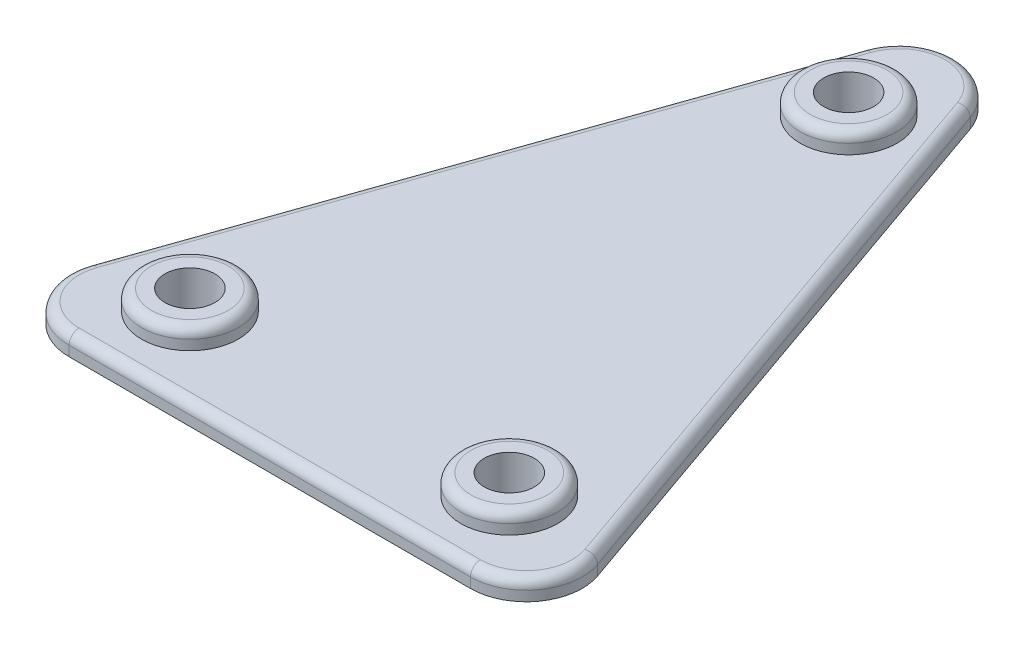
ISO-10303-21;
HEADER;
FILE_DESCRIPTION(('STEP AP214'),'2;1');
FILE_NAME('part.step','',(''),(''),'','','');
FILE_SCHEMA(('AUTOMOTIVE_DESIGN { 1 0 10303 214 1 1 1 1 }'));
ENDSEC;
DATA;
#1=APPLICATION_CONTEXT('core data for automotive mechanical design processes');
#2=APPLICATION_PROTOCOL_DEFINITION('international standard','automotive_design',2000,#1);
#3=PRODUCT_CONTEXT('',#1,'mechanical');
#4=PRODUCT('Part','Part','',(#3));
#5=PRODUCT_RELATED_PRODUCT_CATEGORY('part','',(#4));
#6=PRODUCT_DEFINITION_FORMATION('','',#4);
#7=PRODUCT_DEFINITION_CONTEXT('part definition',#1,'design');
#8=PRODUCT_DEFINITION('design','',#6,#7);
#9=PRODUCT_DEFINITION_SHAPE('','',#8);
#10=(LENGTH_UNIT() NAMED_UNIT(*) SI_UNIT(.MILLI.,.METRE.));
#11=(NAMED_UNIT(*) PLANE_ANGLE_UNIT() SI_UNIT($,.RADIAN.));
#12=(NAMED_UNIT(*) SI_UNIT($,.STERADIAN.) SOLID_ANGLE_UNIT());
#13=UNCERTAINTY_MEASURE_WITH_UNIT(LENGTH_MEASURE(1.E-05),#10,'distance_accuracy_value','');
#14=(GEOMETRIC_REPRESENTATION_CONTEXT(3) GLOBAL_UNCERTAINTY_ASSIGNED_CONTEXT((#13)) GLOBAL_UNIT_ASSIGNED_CONTEXT((#10,
#11,#12)) REPRESENTATION_CONTEXT('',''));
#15=CARTESIAN_POINT('',(0.,0.,0.));
#16=DIRECTION('',(0.,0.,1.));
#17=DIRECTION('',(1.,0.,0.));
#18=AXIS2_PLACEMENT_3D('',#15,#16,#17);
#19=CARTESIAN_POINT('',(-14.,1.,0.));
#20=DIRECTION('',(0.943858356366017,0.,0.330350424728106));
#21=DIRECTION('',(0.330350424728106,0.,-0.943858356366017));
#22=AXIS2_PLACEMENT_3D('',#19,#20,#21);
#23=PLANE('',#22);
#24=DIRECTION('',(0.,-1.,0.));
#25=VECTOR('',#24,1.);
#26=CARTESIAN_POINT('',(-12.6962565837665,1.,-3.72498118923869));
#27=LINE('',#26,#25);
#28=CARTESIAN_POINT('',(-12.6962565837665,0.,-3.72498118923869));
#29=VERTEX_POINT('',#28);
#30=CARTESIAN_POINT('',(-12.6962565837665,0.5,-3.72498118923869));
#31=VERTEX_POINT('',#30);
#32=EDGE_CURVE('E116',#29,#31,#27,.F.);
#33=ORIENTED_EDGE('',*,*,#32,.T.);
#34=DIRECTION('',(-0.330350424728106,0.,0.943858356366017));
#35=VECTOR('',#34,1.);
#36=CARTESIAN_POINT('',(-2.64280339782484,0.5,-32.4491331490719));
#37=LINE('',#36,#35);
#38=CARTESIAN_POINT('',(-2.64280339782485,0.5,-32.4491331490719));
#39=VERTEX_POINT('',#38);
#40=EDGE_CURVE('E11',#31,#39,#37,.F.);
#41=ORIENTED_EDGE('',*,*,#40,.T.);
#42=DIRECTION('',(0.,-1.,0.));
#43=VECTOR('',#42,1.);
#44=CARTESIAN_POINT('',(-2.64280339782485,1.,-32.4491331490719));
#45=LINE('',#44,#43);
#46=CARTESIAN_POINT('',(-2.64280339782485,0.,-32.4491331490719));
#47=VERTEX_POINT('',#46);
#48=EDGE_CURVE('E107',#39,#47,#45,.T.);
#49=ORIENTED_EDGE('',*,*,#48,.T.);
#50=DIRECTION('',(-0.330350424728106,0.,0.943858356366017));
#51=VECTOR('',#50,1.);
#52=CARTESIAN_POINT('',(-14.,0.,0.));
#53=LINE('',#52,#51);
#54=EDGE_CURVE('E110',#47,#29,#53,.T.);
#55=ORIENTED_EDGE('',*,*,#54,.T.);
#56=EDGE_LOOP('',(#33,#41,#49,#55));
#57=FACE_BOUND('',#56,.T.);
#58=ADVANCED_FACE('F33',(#57),#23,.F.);
#59=CARTESIAN_POINT('',(14.,1.,0.));
#60=DIRECTION('',(0.,0.,-1.));
#61=DIRECTION('',(-1.,0.,0.));
#62=AXIS2_PLACEMENT_3D('',#59,#60,#61);
#63=PLANE('',#62);
#64=DIRECTION('',(0.,-1.,0.));
#65=VECTOR('',#64,1.);
#66=CARTESIAN_POINT('',(10.0534531859416,1.,0.));
#67=LINE('',#66,#65);
#68=CARTESIAN_POINT('',(10.0534531859416,0.,0.));
#69=VERTEX_POINT('',#68);
#70=CARTESIAN_POINT('',(10.0534531859416,0.5,0.));
#71=VERTEX_POINT('',#70);
#72=EDGE_CURVE('E151',#69,#71,#67,.F.);
#73=ORIENTED_EDGE('',*,*,#72,.T.);
#74=DIRECTION('',(1.,0.,0.));
#75=VECTOR('',#74,1.);
#76=CARTESIAN_POINT('',(-10.0534531859416,0.5,0.));
#77=LINE('',#76,#75);
#78=CARTESIAN_POINT('',(-10.0534531859416,0.5,0.));
#79=VERTEX_POINT('',#78);
#80=EDGE_CURVE('E58',#71,#79,#77,.F.);
#81=ORIENTED_EDGE('',*,*,#80,.T.);
#82=DIRECTION('',(0.,-1.,0.));
#83=VECTOR('',#82,1.);
#84=CARTESIAN_POINT('',(-10.0534531859416,1.,0.));
#85=LINE('',#84,#83);
#86=CARTESIAN_POINT('',(-10.0534531859416,0.,0.));
#87=VERTEX_POINT('',#86);
#88=EDGE_CURVE('E149',#79,#87,#85,.T.);
#89=ORIENTED_EDGE('',*,*,#88,.T.);
#90=DIRECTION('',(1.,0.,0.));
#91=VECTOR('',#90,1.);
#92=CARTESIAN_POINT('',(14.,0.,0.));
#93=LINE('',#92,#91);
#94=EDGE_CURVE('E132',#87,#69,#93,.T.);
#95=ORIENTED_EDGE('',*,*,#94,.T.);
#96=EDGE_LOOP('',(#73,#81,#89,#95));
#97=FACE_BOUND('',#96,.T.);
#98=ADVANCED_FACE('F259',(#97),#63,.F.);
#99=CARTESIAN_POINT('',(14.,1.,0.));
#100=DIRECTION('',(-0.943858356366017,0.,0.330350424728106));
#101=DIRECTION('',(0.330350424728106,0.,0.943858356366017));
#102=AXIS2_PLACEMENT_3D('',#99,#100,#101);
#103=PLANE('',#102);
#104=DIRECTION('',(0.,-1.,0.));
#105=VECTOR('',#104,1.);
#106=CARTESIAN_POINT('',(2.64280339782485,1.,-32.4491331490719));
#107=LINE('',#106,#105);
#108=CARTESIAN_POINT('',(2.64280339782485,0.,-32.4491331490719));
#109=VERTEX_POINT('',#108);
#110=CARTESIAN_POINT('',(2.64280339782485,0.5,-32.4491331490719));
#111=VERTEX_POINT('',#110);
#112=EDGE_CURVE('E122',#109,#111,#107,.F.);
#113=ORIENTED_EDGE('',*,*,#112,.T.);
#114=DIRECTION('',(-0.330350424728106,0.,-0.943858356366017));
#115=VECTOR('',#114,1.);
#116=CARTESIAN_POINT('',(12.6962565837665,0.5,-3.72498118923869));
#117=LINE('',#116,#115);
#118=CARTESIAN_POINT('',(12.6962565837665,0.5,-3.72498118923869));
#119=VERTEX_POINT('',#118);
#120=EDGE_CURVE('E168',#111,#119,#117,.F.);
#121=ORIENTED_EDGE('',*,*,#120,.T.);
#122=DIRECTION('',(0.,-1.,0.));
#123=VECTOR('',#122,1.);
#124=CARTESIAN_POINT('',(12.6962565837665,1.,-3.72498118923869));
#125=LINE('',#124,#123);
#126=CARTESIAN_POINT('',(12.6962565837665,0.,-3.72498118923869));
#127=VERTEX_POINT('',#126);
#128=EDGE_CURVE('E126',#119,#127,#125,.T.);
#129=ORIENTED_EDGE('',*,*,#128,.T.);
#130=DIRECTION('',(-0.330350424728106,0.,-0.943858356366017));
#131=VECTOR('',#130,1.);
#132=CARTESIAN_POINT('',(14.,0.,0.));
#133=LINE('',#132,#131);
#134=EDGE_CURVE('E136',#127,#109,#133,.T.);
#135=ORIENTED_EDGE('',*,*,#134,.T.);
#136=EDGE_LOOP('',(#113,#121,#129,#135));
#137=FACE_BOUND('',#136,.T.);
#138=ADVANCED_FACE('F240',(#137),#103,.F.);
#139=CARTESIAN_POINT('',(0.,1.,0.));
#140=DIRECTION('',(0.,1.,0.));
#141=DIRECTION('',(0.,0.,1.));
#142=AXIS2_PLACEMENT_3D('',#139,#140,#141);
#143=PLANE('',#142);
#144=DIRECTION('',(-0.330350424728106,0.,-0.943858356366017));
#145=VECTOR('',#144,1.);
#146=CARTESIAN_POINT('',(2.17087421964184,1.,-32.2839579367078));
#147=LINE('',#146,#145);
#148=CARTESIAN_POINT('',(12.2243274055834,1.,-3.55980597687464));
#149=VERTEX_POINT('',#148);
#150=CARTESIAN_POINT('',(2.17087421964184,1.,-32.2839579367078));
#151=VERTEX_POINT('',#150);
#152=EDGE_CURVE('E161',#149,#151,#147,.T.);
#153=ORIENTED_EDGE('',*,*,#152,.T.);
#154=CARTESIAN_POINT('',(0.,1.,-31.5241519598332));
#155=DIRECTION('',(0.,1.,0.));
#156=DIRECTION('',(0.,0.,1.));
#157=AXIS2_PLACEMENT_3D('',#154,#155,#156);
#158=CIRCLE('',#157,2.3);
#159=CARTESIAN_POINT('',(-2.17087421964184,1.,-32.2839579367078));
#160=VERTEX_POINT('',#159);
#161=EDGE_CURVE('E163',#151,#160,#158,.T.);
#162=ORIENTED_EDGE('',*,*,#161,.T.);
#163=DIRECTION('',(-0.330350424728106,0.,0.943858356366017));
#164=VECTOR('',#163,1.);
#165=CARTESIAN_POINT('',(-12.2243274055834,1.,-3.55980597687464));
#166=LINE('',#165,#164);
#167=CARTESIAN_POINT('',(-12.2243274055834,1.,-3.55980597687464));
#168=VERTEX_POINT('',#167);
#169=EDGE_CURVE('E153',#160,#168,#166,.T.);
#170=ORIENTED_EDGE('',*,*,#169,.T.);
#171=CARTESIAN_POINT('',(-10.0534531859416,1.,-2.8));
#172=DIRECTION('',(0.,1.,0.));
#173=DIRECTION('',(0.,0.,1.));
#174=AXIS2_PLACEMENT_3D('',#171,#172,#173);
#175=CIRCLE('',#174,2.3);
#176=CARTESIAN_POINT('',(-10.0534531859416,1.,-0.499999999999997));
#177=VERTEX_POINT('',#176);
#178=EDGE_CURVE('E155',#168,#177,#175,.T.);
#179=ORIENTED_EDGE('',*,*,#178,.T.);
#180=DIRECTION('',(1.,0.,0.));
#181=VECTOR('',#180,1.);
#182=CARTESIAN_POINT('',(10.0534531859416,1.,-0.499999999999997));
#183=LINE('',#182,#181);
#184=CARTESIAN_POINT('',(10.0534531859416,1.,-0.499999999999997));
#185=VERTEX_POINT('',#184);
#186=EDGE_CURVE('E157',#177,#185,#183,.T.);
#187=ORIENTED_EDGE('',*,*,#186,.T.);
#188=CARTESIAN_POINT('',(10.0534531859416,1.,-2.8));
#189=DIRECTION('',(0.,1.,0.));
#190=DIRECTION('',(0.,0.,1.));
#191=AXIS2_PLACEMENT_3D('',#188,#189,#190);
#192=CIRCLE('',#191,2.3);
#193=EDGE_CURVE('E159',#185,#149,#192,.T.);
#194=ORIENTED_EDGE('',*,*,#193,.T.);
#195=EDGE_LOOP('',(#153,#162,#170,#179,#187,#194));
#196=FACE_BOUND('',#195,.T.);
#197=CARTESIAN_POINT('',(8.,1.,-4.));
#198=DIRECTION('',(0.,1.,0.));
#199=DIRECTION('',(0.,0.,1.));
#200=AXIS2_PLACEMENT_3D('',#197,#198,#199);
#201=CIRCLE('',#200,2.425);
#202=CARTESIAN_POINT('',(8.,1.,-1.575));
#203=VERTEX_POINT('',#202);
#204=EDGE_CURVE('E230',#203,#203,#201,.T.);
#205=ORIENTED_EDGE('',*,*,#204,.F.);
#206=EDGE_LOOP('',(#205));
#207=FACE_BOUND('',#206,.T.);
#208=CARTESIAN_POINT('',(0.,1.,-29.));
#209=DIRECTION('',(0.,1.,0.));
#210=DIRECTION('',(0.,0.,1.));
#211=AXIS2_PLACEMENT_3D('',#208,#209,#210);
#212=CIRCLE('',#211,2.425);
#213=CARTESIAN_POINT('',(0.,1.,-26.575));
#214=VERTEX_POINT('',#213);
#215=EDGE_CURVE('E139',#214,#214,#212,.T.);
#216=ORIENTED_EDGE('',*,*,#215,.F.);
#217=EDGE_LOOP('',(#216));
#218=FACE_BOUND('',#217,.T.);
#219=CARTESIAN_POINT('',(-8.,1.,-4.));
#220=DIRECTION('',(0.,1.,0.));
#221=DIRECTION('',(0.,0.,1.));
#222=AXIS2_PLACEMENT_3D('',#219,#220,#221);
#223=CIRCLE('',#222,2.425);
#224=CARTESIAN_POINT('',(-8.,1.,-1.575));
#225=VERTEX_POINT('',#224);
#226=EDGE_CURVE('E133',#225,#225,#223,.T.);
#227=ORIENTED_EDGE('',*,*,#226,.F.);
#228=EDGE_LOOP('',(#227));
#229=FACE_BOUND('',#228,.T.);
#230=ADVANCED_FACE('F237',(#196,#207,#218,#229),#143,.T.);
#231=CARTESIAN_POINT('',(0.,0.,0.));
#232=DIRECTION('',(0.,1.,0.));
#233=DIRECTION('',(0.,0.,1.));
#234=AXIS2_PLACEMENT_3D('',#231,#232,#233);
#235=PLANE('',#234);
#236=CARTESIAN_POINT('',(0.,0.,-29.));
#237=DIRECTION('',(0.,1.,0.));
#238=DIRECTION('',(0.,0.,1.));
#239=AXIS2_PLACEMENT_3D('',#236,#237,#238);
#240=CIRCLE('',#239,1.25);
#241=CARTESIAN_POINT('',(0.,0.,-27.75));
#242=VERTEX_POINT('',#241);
#243=EDGE_CURVE('E224',#242,#242,#240,.T.);
#244=ORIENTED_EDGE('',*,*,#243,.T.);
#245=EDGE_LOOP('',(#244));
#246=FACE_BOUND('',#245,.T.);
#247=CARTESIAN_POINT('',(-8.,0.,-4.));
#248=DIRECTION('',(0.,1.,0.));
#249=DIRECTION('',(0.,0.,1.));
#250=AXIS2_PLACEMENT_3D('',#247,#248,#249);
#251=CIRCLE('',#250,1.25);
#252=CARTESIAN_POINT('',(-8.,0.,-2.75));
#253=VERTEX_POINT('',#252);
#254=EDGE_CURVE('E227',#253,#253,#251,.T.);
#255=ORIENTED_EDGE('',*,*,#254,.T.);
#256=EDGE_LOOP('',(#255));
#257=FACE_BOUND('',#256,.T.);
#258=CARTESIAN_POINT('',(8.,0.,-4.));
#259=DIRECTION('',(0.,1.,0.));
#260=DIRECTION('',(0.,0.,1.));
#261=AXIS2_PLACEMENT_3D('',#258,#259,#260);
#262=CIRCLE('',#261,1.25);
#263=CARTESIAN_POINT('',(8.,0.,-2.75));
#264=VERTEX_POINT('',#263);
#265=EDGE_CURVE('E221',#264,#264,#262,.T.);
#266=ORIENTED_EDGE('',*,*,#265,.T.);
#267=EDGE_LOOP('',(#266));
#268=FACE_BOUND('',#267,.T.);
#269=ORIENTED_EDGE('',*,*,#54,.F.);
#270=CARTESIAN_POINT('',(0.,0.,-31.5241519598332));
#271=DIRECTION('',(0.,1.,0.));
#272=DIRECTION('',(0.,0.,1.));
#273=AXIS2_PLACEMENT_3D('',#270,#271,#272);
#274=CIRCLE('',#273,2.8);
#275=EDGE_CURVE('E119',#47,#109,#274,.F.);
#276=ORIENTED_EDGE('',*,*,#275,.T.);
#277=ORIENTED_EDGE('',*,*,#134,.F.);
#278=CARTESIAN_POINT('',(10.0534531859416,0.,-2.8));
#279=DIRECTION('',(0.,1.,0.));
#280=DIRECTION('',(0.,0.,1.));
#281=AXIS2_PLACEMENT_3D('',#278,#279,#280);
#282=CIRCLE('',#281,2.8);
#283=EDGE_CURVE('E127',#127,#69,#282,.F.);
#284=ORIENTED_EDGE('',*,*,#283,.T.);
#285=ORIENTED_EDGE('',*,*,#94,.F.);
#286=CARTESIAN_POINT('',(-10.0534531859416,0.,-2.8));
#287=DIRECTION('',(0.,1.,0.));
#288=DIRECTION('',(0.,0.,1.));
#289=AXIS2_PLACEMENT_3D('',#286,#287,#288);
#290=CIRCLE('',#289,2.8);
#291=EDGE_CURVE('E115',#87,#29,#290,.F.);
#292=ORIENTED_EDGE('',*,*,#291,.T.);
#293=EDGE_LOOP('',(#269,#276,#277,#284,#285,#292));
#294=FACE_BOUND('',#293,.T.);
#295=ADVANCED_FACE('F129',(#246,#257,#268,#294),#235,.F.);
#296=CARTESIAN_POINT('',(-8.,2.,-4.));
#297=DIRECTION('',(0.,-1.,0.));
#298=DIRECTION('',(0.,0.,-1.));
#299=AXIS2_PLACEMENT_3D('',#296,#297,#298);
#300=CYLINDRICAL_SURFACE('',#299,2.425);
#301=CARTESIAN_POINT('',(-8.,1.5,-4.));
#302=DIRECTION('',(0.,1.,0.));
#303=DIRECTION('',(0.,0.,1.));
#304=AXIS2_PLACEMENT_3D('',#301,#302,#303);
#305=CIRCLE('',#304,2.425);
#306=CARTESIAN_POINT('',(-8.,1.5,-1.575));
#307=VERTEX_POINT('',#306);
#308=EDGE_CURVE('E183',#307,#307,#305,.F.);
#309=ORIENTED_EDGE('',*,*,#308,.T.);
#310=EDGE_LOOP('',(#309));
#311=FACE_BOUND('',#310,.T.);
#312=ORIENTED_EDGE('',*,*,#226,.T.);
#313=EDGE_LOOP('',(#312));
#314=FACE_BOUND('',#313,.T.);
#315=ADVANCED_FACE('F245',(#311,#314),#300,.T.);
#316=CARTESIAN_POINT('',(-8.,2.,-4.));
#317=DIRECTION('',(0.,1.,0.));
#318=DIRECTION('',(0.,0.,1.));
#319=AXIS2_PLACEMENT_3D('',#316,#317,#318);
#320=PLANE('',#319);
#321=CARTESIAN_POINT('',(-8.,2.,-4.));
#322=DIRECTION('',(0.,1.,0.));
#323=DIRECTION('',(0.,0.,1.));
#324=AXIS2_PLACEMENT_3D('',#321,#322,#323);
#325=CIRCLE('',#324,1.925);
#326=CARTESIAN_POINT('',(-8.,2.,-2.075));
#327=VERTEX_POINT('',#326);
#328=EDGE_CURVE('E180',#327,#327,#325,.T.);
#329=ORIENTED_EDGE('',*,*,#328,.T.);
#330=EDGE_LOOP('',(#329));
#331=FACE_BOUND('',#330,.T.);
#332=CARTESIAN_POINT('',(-8.,2.,-4.));
#333=DIRECTION('',(0.,1.,0.));
#334=DIRECTION('',(0.,0.,1.));
#335=AXIS2_PLACEMENT_3D('',#332,#333,#334);
#336=CIRCLE('',#335,1.25);
#337=CARTESIAN_POINT('',(-8.,2.,-2.75));
#338=VERTEX_POINT('',#337);
#339=EDGE_CURVE('E212',#338,#338,#336,.T.);
#340=ORIENTED_EDGE('',*,*,#339,.F.);
#341=EDGE_LOOP('',(#340));
#342=FACE_BOUND('',#341,.T.);
#343=ADVANCED_FACE('F247',(#331,#342),#320,.T.);
#344=CARTESIAN_POINT('',(0.,2.,-29.));
#345=DIRECTION('',(0.,-1.,0.));
#346=DIRECTION('',(0.,0.,-1.));
#347=AXIS2_PLACEMENT_3D('',#344,#345,#346);
#348=CYLINDRICAL_SURFACE('',#347,2.425);
#349=CARTESIAN_POINT('',(0.,1.5,-29.));
#350=DIRECTION('',(0.,1.,0.));
#351=DIRECTION('',(0.,0.,1.));
#352=AXIS2_PLACEMENT_3D('',#349,#350,#351);
#353=CIRCLE('',#352,2.425);
#354=CARTESIAN_POINT('',(0.,1.5,-26.575));
#355=VERTEX_POINT('',#354);
#356=EDGE_CURVE('E42',#355,#355,#353,.F.);
#357=ORIENTED_EDGE('',*,*,#356,.T.);
#358=EDGE_LOOP('',(#357));
#359=FACE_BOUND('',#358,.T.);
#360=ORIENTED_EDGE('',*,*,#215,.T.);
#361=EDGE_LOOP('',(#360));
#362=FACE_BOUND('',#361,.T.);
#363=ADVANCED_FACE('F235',(#359,#362),#348,.T.);
#364=CARTESIAN_POINT('',(0.,2.,-29.));
#365=DIRECTION('',(0.,1.,0.));
#366=DIRECTION('',(0.,0.,1.));
#367=AXIS2_PLACEMENT_3D('',#364,#365,#366);
#368=PLANE('',#367);
#369=CARTESIAN_POINT('',(0.,2.,-29.));
#370=DIRECTION('',(0.,1.,0.));
#371=DIRECTION('',(0.,0.,1.));
#372=AXIS2_PLACEMENT_3D('',#369,#370,#371);
#373=CIRCLE('',#372,1.925);
#374=CARTESIAN_POINT('',(0.,2.,-27.075));
#375=VERTEX_POINT('',#374);
#376=EDGE_CURVE('E186',#375,#375,#373,.T.);
#377=ORIENTED_EDGE('',*,*,#376,.T.);
#378=EDGE_LOOP('',(#377));
#379=FACE_BOUND('',#378,.T.);
#380=CARTESIAN_POINT('',(0.,2.,-29.));
#381=DIRECTION('',(0.,1.,0.));
#382=DIRECTION('',(0.,0.,1.));
#383=AXIS2_PLACEMENT_3D('',#380,#381,#382);
#384=CIRCLE('',#383,1.25);
#385=CARTESIAN_POINT('',(0.,2.,-27.75));
#386=VERTEX_POINT('',#385);
#387=EDGE_CURVE('E217',#386,#386,#384,.T.);
#388=ORIENTED_EDGE('',*,*,#387,.F.);
#389=EDGE_LOOP('',(#388));
#390=FACE_BOUND('',#389,.T.);
#391=ADVANCED_FACE('F340',(#379,#390),#368,.T.);
#392=CARTESIAN_POINT('',(8.,2.,-4.));
#393=DIRECTION('',(0.,-1.,0.));
#394=DIRECTION('',(0.,0.,-1.));
#395=AXIS2_PLACEMENT_3D('',#392,#393,#394);
#396=CYLINDRICAL_SURFACE('',#395,2.425);
#397=CARTESIAN_POINT('',(8.,1.5,-4.));
#398=DIRECTION('',(0.,1.,0.));
#399=DIRECTION('',(0.,0.,1.));
#400=AXIS2_PLACEMENT_3D('',#397,#398,#399);
#401=CIRCLE('',#400,2.425);
#402=CARTESIAN_POINT('',(8.,1.5,-1.575));
#403=VERTEX_POINT('',#402);
#404=EDGE_CURVE('E177',#403,#403,#401,.F.);
#405=ORIENTED_EDGE('',*,*,#404,.T.);
#406=EDGE_LOOP('',(#405));
#407=FACE_BOUND('',#406,.T.);
#408=ORIENTED_EDGE('',*,*,#204,.T.);
#409=EDGE_LOOP('',(#408));
#410=FACE_BOUND('',#409,.T.);
#411=ADVANCED_FACE('F334',(#407,#410),#396,.T.);
#412=CARTESIAN_POINT('',(8.,2.,-4.));
#413=DIRECTION('',(0.,1.,0.));
#414=DIRECTION('',(0.,0.,1.));
#415=AXIS2_PLACEMENT_3D('',#412,#413,#414);
#416=PLANE('',#415);
#417=CARTESIAN_POINT('',(8.,2.,-4.));
#418=DIRECTION('',(0.,1.,0.));
#419=DIRECTION('',(0.,0.,1.));
#420=AXIS2_PLACEMENT_3D('',#417,#418,#419);
#421=CIRCLE('',#420,1.925);
#422=CARTESIAN_POINT('',(8.,2.,-2.075));
#423=VERTEX_POINT('',#422);
#424=EDGE_CURVE('E174',#423,#423,#421,.T.);
#425=ORIENTED_EDGE('',*,*,#424,.T.);
#426=EDGE_LOOP('',(#425));
#427=FACE_BOUND('',#426,.T.);
#428=CARTESIAN_POINT('',(8.,2.,-4.));
#429=DIRECTION('',(0.,1.,0.));
#430=DIRECTION('',(0.,0.,1.));
#431=AXIS2_PLACEMENT_3D('',#428,#429,#430);
#432=CIRCLE('',#431,1.25);
#433=CARTESIAN_POINT('',(8.,2.,-2.75));
#434=VERTEX_POINT('',#433);
#435=EDGE_CURVE('E206',#434,#434,#432,.T.);
#436=ORIENTED_EDGE('',*,*,#435,.F.);
#437=EDGE_LOOP('',(#436));
#438=FACE_BOUND('',#437,.T.);
#439=ADVANCED_FACE('F326',(#427,#438),#416,.T.);
#440=CARTESIAN_POINT('',(8.,-1.2E-05,-4.));
#441=DIRECTION('',(0.,1.,0.));
#442=DIRECTION('',(0.,0.,1.));
#443=AXIS2_PLACEMENT_3D('',#440,#441,#442);
#444=CYLINDRICAL_SURFACE('',#443,1.25);
#445=ORIENTED_EDGE('',*,*,#435,.T.);
#446=EDGE_LOOP('',(#445));
#447=FACE_BOUND('',#446,.T.);
#448=ORIENTED_EDGE('',*,*,#265,.F.);
#449=EDGE_LOOP('',(#448));
#450=FACE_BOUND('',#449,.T.);
#451=ADVANCED_FACE('F324',(#447,#450),#444,.F.);
#452=CARTESIAN_POINT('',(0.,-1.2E-05,-29.));
#453=DIRECTION('',(0.,1.,0.));
#454=DIRECTION('',(0.,0.,1.));
#455=AXIS2_PLACEMENT_3D('',#452,#453,#454);
#456=CYLINDRICAL_SURFACE('',#455,1.25);
#457=ORIENTED_EDGE('',*,*,#387,.T.);
#458=EDGE_LOOP('',(#457));
#459=FACE_BOUND('',#458,.T.);
#460=ORIENTED_EDGE('',*,*,#243,.F.);
#461=EDGE_LOOP('',(#460));
#462=FACE_BOUND('',#461,.T.);
#463=ADVANCED_FACE('F317',(#459,#462),#456,.F.);
#464=CARTESIAN_POINT('',(-8.,-1.2E-05,-4.));
#465=DIRECTION('',(0.,1.,0.));
#466=DIRECTION('',(0.,0.,1.));
#467=AXIS2_PLACEMENT_3D('',#464,#465,#466);
#468=CYLINDRICAL_SURFACE('',#467,1.25);
#469=ORIENTED_EDGE('',*,*,#339,.T.);
#470=EDGE_LOOP('',(#469));
#471=FACE_BOUND('',#470,.T.);
#472=ORIENTED_EDGE('',*,*,#254,.F.);
#473=EDGE_LOOP('',(#472));
#474=FACE_BOUND('',#473,.T.);
#475=ADVANCED_FACE('F270',(#471,#474),#468,.F.);
#476=CARTESIAN_POINT('',(0.,1.,-31.5241519598332));
#477=DIRECTION('',(0.,-1.,0.));
#478=DIRECTION('',(0.,0.,-1.));
#479=AXIS2_PLACEMENT_3D('',#476,#477,#478);
#480=CYLINDRICAL_SURFACE('',#479,2.8);
#481=ORIENTED_EDGE('',*,*,#48,.F.);
#482=CARTESIAN_POINT('',(0.,0.5,-31.5241519598332));
#483=DIRECTION('',(0.,1.,0.));
#484=DIRECTION('',(0.,0.,1.));
#485=AXIS2_PLACEMENT_3D('',#482,#483,#484);
#486=CIRCLE('',#485,2.8);
#487=EDGE_CURVE('E166',#39,#111,#486,.F.);
#488=ORIENTED_EDGE('',*,*,#487,.T.);
#489=ORIENTED_EDGE('',*,*,#112,.F.);
#490=ORIENTED_EDGE('',*,*,#275,.F.);
#491=EDGE_LOOP('',(#481,#488,#489,#490));
#492=FACE_BOUND('',#491,.T.);
#493=ADVANCED_FACE('F120',(#492),#480,.T.);
#494=CARTESIAN_POINT('',(10.0534531859416,1.,-2.8));
#495=DIRECTION('',(0.,-1.,0.));
#496=DIRECTION('',(0.,0.,-1.));
#497=AXIS2_PLACEMENT_3D('',#494,#495,#496);
#498=CYLINDRICAL_SURFACE('',#497,2.8);
#499=ORIENTED_EDGE('',*,*,#128,.F.);
#500=CARTESIAN_POINT('',(10.0534531859416,0.5,-2.8));
#501=DIRECTION('',(0.,1.,0.));
#502=DIRECTION('',(0.,0.,1.));
#503=AXIS2_PLACEMENT_3D('',#500,#501,#502);
#504=CIRCLE('',#503,2.8);
#505=EDGE_CURVE('E170',#119,#71,#504,.F.);
#506=ORIENTED_EDGE('',*,*,#505,.T.);
#507=ORIENTED_EDGE('',*,*,#72,.F.);
#508=ORIENTED_EDGE('',*,*,#283,.F.);
#509=EDGE_LOOP('',(#499,#506,#507,#508));
#510=FACE_BOUND('',#509,.T.);
#511=ADVANCED_FACE('F269',(#510),#498,.T.);
#512=CARTESIAN_POINT('',(-10.0534531859416,1.,-2.8));
#513=DIRECTION('',(0.,-1.,0.));
#514=DIRECTION('',(0.,0.,-1.));
#515=AXIS2_PLACEMENT_3D('',#512,#513,#514);
#516=CYLINDRICAL_SURFACE('',#515,2.8);
#517=ORIENTED_EDGE('',*,*,#88,.F.);
#518=CARTESIAN_POINT('',(-10.0534531859416,0.5,-2.8));
#519=DIRECTION('',(0.,1.,0.));
#520=DIRECTION('',(0.,0.,1.));
#521=AXIS2_PLACEMENT_3D('',#518,#519,#520);
#522=CIRCLE('',#521,2.8);
#523=EDGE_CURVE('E50',#79,#31,#522,.F.);
#524=ORIENTED_EDGE('',*,*,#523,.T.);
#525=ORIENTED_EDGE('',*,*,#32,.F.);
#526=ORIENTED_EDGE('',*,*,#291,.F.);
#527=EDGE_LOOP('',(#517,#524,#525,#526));
#528=FACE_BOUND('',#527,.T.);
#529=ADVANCED_FACE('F273',(#528),#516,.T.);
#530=CARTESIAN_POINT('',(0.,0.5,-0.499999999999997));
#531=DIRECTION('',(-1.,0.,0.));
#532=DIRECTION('',(0.,0.,1.));
#533=AXIS2_PLACEMENT_3D('',#530,#531,#532);
#534=CYLINDRICAL_SURFACE('',#533,0.5);
#535=CARTESIAN_POINT('',(-10.0534531859416,0.5,-0.499999999999997));
#536=DIRECTION('',(-1.,0.,0.));
#537=DIRECTION('',(0.,0.,1.));
#538=AXIS2_PLACEMENT_3D('',#535,#536,#537);
#539=CIRCLE('',#538,0.5);
#540=EDGE_CURVE('E200',#79,#177,#539,.T.);
#541=ORIENTED_EDGE('',*,*,#540,.F.);
#542=ORIENTED_EDGE('',*,*,#80,.F.);
#543=CARTESIAN_POINT('',(10.0534531859416,0.5,-0.499999999999997));
#544=DIRECTION('',(1.,0.,0.));
#545=DIRECTION('',(0.,0.,-1.));
#546=AXIS2_PLACEMENT_3D('',#543,#544,#545);
#547=CIRCLE('',#546,0.5);
#548=EDGE_CURVE('E37',#185,#71,#547,.T.);
#549=ORIENTED_EDGE('',*,*,#548,.F.);
#550=ORIENTED_EDGE('',*,*,#186,.F.);
#551=EDGE_LOOP('',(#541,#542,#549,#550));
#552=FACE_BOUND('',#551,.T.);
#553=ADVANCED_FACE('F277',(#552),#534,.T.);
#554=CARTESIAN_POINT('',(10.0534531859416,0.5,-2.8));
#555=DIRECTION('',(0.,1.,0.));
#556=DIRECTION('',(0.,0.,1.));
#557=AXIS2_PLACEMENT_3D('',#554,#555,#556);
#558=TOROIDAL_SURFACE('',#557,2.3,0.5);
#559=ORIENTED_EDGE('',*,*,#548,.T.);
#560=ORIENTED_EDGE('',*,*,#505,.F.);
#561=CARTESIAN_POINT('',(12.2243274055834,0.5,-3.55980597687464));
#562=DIRECTION('',(-0.330350424728106,0.,-0.943858356366018));
#563=DIRECTION('',(-0.943858356366018,0.,0.330350424728106));
#564=AXIS2_PLACEMENT_3D('',#561,#562,#563);
#565=CIRCLE('',#564,0.5);
#566=EDGE_CURVE('E198',#149,#119,#565,.T.);
#567=ORIENTED_EDGE('',*,*,#566,.F.);
#568=ORIENTED_EDGE('',*,*,#193,.F.);
#569=EDGE_LOOP('',(#559,#560,#567,#568));
#570=FACE_BOUND('',#569,.T.);
#571=ADVANCED_FACE('F294',(#570),#558,.T.);
#572=CARTESIAN_POINT('',(-10.0534531859416,0.5,-2.8));
#573=DIRECTION('',(0.,1.,0.));
#574=DIRECTION('',(0.,0.,1.));
#575=AXIS2_PLACEMENT_3D('',#572,#573,#574);
#576=TOROIDAL_SURFACE('',#575,2.3,0.5);
#577=ORIENTED_EDGE('',*,*,#540,.T.);
#578=ORIENTED_EDGE('',*,*,#178,.F.);
#579=CARTESIAN_POINT('',(-12.2243274055834,0.5,-3.55980597687464));
#580=DIRECTION('',(0.330350424728106,0.,-0.943858356366018));
#581=DIRECTION('',(-0.943858356366018,0.,-0.330350424728106));
#582=AXIS2_PLACEMENT_3D('',#579,#580,#581);
#583=CIRCLE('',#582,0.5);
#584=EDGE_CURVE('E195',#31,#168,#583,.T.);
#585=ORIENTED_EDGE('',*,*,#584,.F.);
#586=ORIENTED_EDGE('',*,*,#523,.F.);
#587=EDGE_LOOP('',(#577,#578,#585,#586));
#588=FACE_BOUND('',#587,.T.);
#589=ADVANCED_FACE('F290',(#588),#576,.T.);
#590=CARTESIAN_POINT('',(12.0002311781644,0.5,-4.20008091235755));
#591=DIRECTION('',(0.330350424728106,0.,0.943858356366017));
#592=DIRECTION('',(0.943858356366017,0.,-0.330350424728106));
#593=AXIS2_PLACEMENT_3D('',#590,#591,#592);
#594=CYLINDRICAL_SURFACE('',#593,0.5);
#595=ORIENTED_EDGE('',*,*,#566,.T.);
#596=ORIENTED_EDGE('',*,*,#120,.F.);
#597=CARTESIAN_POINT('',(2.17087421964184,0.5,-32.2839579367078));
#598=DIRECTION('',(-0.330350424728107,0.,-0.943858356366017));
#599=DIRECTION('',(-0.943858356366017,0.,0.330350424728107));
#600=AXIS2_PLACEMENT_3D('',#597,#598,#599);
#601=CIRCLE('',#600,0.5);
#602=EDGE_CURVE('E193',#151,#111,#601,.T.);
#603=ORIENTED_EDGE('',*,*,#602,.F.);
#604=ORIENTED_EDGE('',*,*,#152,.F.);
#605=EDGE_LOOP('',(#595,#596,#603,#604));
#606=FACE_BOUND('',#605,.T.);
#607=ADVANCED_FACE('F286',(#606),#594,.T.);
#608=CARTESIAN_POINT('',(-12.0002311781644,0.5,-4.20008091235755));
#609=DIRECTION('',(0.330350424728106,0.,-0.943858356366017));
#610=DIRECTION('',(-0.943858356366017,0.,-0.330350424728106));
#611=AXIS2_PLACEMENT_3D('',#608,#609,#610);
#612=CYLINDRICAL_SURFACE('',#611,0.5);
#613=ORIENTED_EDGE('',*,*,#584,.T.);
#614=ORIENTED_EDGE('',*,*,#169,.F.);
#615=CARTESIAN_POINT('',(-2.17087421964184,0.5,-32.2839579367078));
#616=DIRECTION('',(0.330350424728107,0.,-0.943858356366017));
#617=DIRECTION('',(-0.943858356366017,0.,-0.330350424728107));
#618=AXIS2_PLACEMENT_3D('',#615,#616,#617);
#619=CIRCLE('',#618,0.5);
#620=EDGE_CURVE('E191',#39,#160,#619,.T.);
#621=ORIENTED_EDGE('',*,*,#620,.F.);
#622=ORIENTED_EDGE('',*,*,#40,.F.);
#623=EDGE_LOOP('',(#613,#614,#621,#622));
#624=FACE_BOUND('',#623,.T.);
#625=ADVANCED_FACE('F282',(#624),#612,.T.);
#626=CARTESIAN_POINT('',(0.,0.5,-31.5241519598332));
#627=DIRECTION('',(0.,1.,0.));
#628=DIRECTION('',(0.,0.,1.));
#629=AXIS2_PLACEMENT_3D('',#626,#627,#628);
#630=TOROIDAL_SURFACE('',#629,2.3,0.5);
#631=ORIENTED_EDGE('',*,*,#602,.T.);
#632=ORIENTED_EDGE('',*,*,#487,.F.);
#633=ORIENTED_EDGE('',*,*,#620,.T.);
#634=ORIENTED_EDGE('',*,*,#161,.F.);
#635=EDGE_LOOP('',(#631,#632,#633,#634));
#636=FACE_BOUND('',#635,.T.);
#637=ADVANCED_FACE('F278',(#636),#630,.T.);
#638=CARTESIAN_POINT('',(8.,1.5,-4.));
#639=DIRECTION('',(0.,1.,0.));
#640=DIRECTION('',(0.,0.,1.));
#641=AXIS2_PLACEMENT_3D('',#638,#639,#640);
#642=TOROIDAL_SURFACE('',#641,1.925,0.5);
#643=ORIENTED_EDGE('',*,*,#404,.F.);
#644=EDGE_LOOP('',(#643));
#645=FACE_BOUND('',#644,.T.);
#646=ORIENTED_EDGE('',*,*,#424,.F.);
#647=EDGE_LOOP('',(#646));
#648=FACE_BOUND('',#647,.T.);
#649=ADVANCED_FACE('F281',(#645,#648),#642,.T.);
#650=CARTESIAN_POINT('',(-8.,1.5,-4.));
#651=DIRECTION('',(0.,1.,0.));
#652=DIRECTION('',(0.,0.,1.));
#653=AXIS2_PLACEMENT_3D('',#650,#651,#652);
#654=TOROIDAL_SURFACE('',#653,1.925,0.5);
#655=ORIENTED_EDGE('',*,*,#308,.F.);
#656=EDGE_LOOP('',(#655));
#657=FACE_BOUND('',#656,.T.);
#658=ORIENTED_EDGE('',*,*,#328,.F.);
#659=EDGE_LOOP('',(#658));
#660=FACE_BOUND('',#659,.T.);
#661=ADVANCED_FACE('F301',(#657,#660),#654,.T.);
#662=CARTESIAN_POINT('',(0.,1.5,-29.));
#663=DIRECTION('',(0.,1.,0.));
#664=DIRECTION('',(0.,0.,1.));
#665=AXIS2_PLACEMENT_3D('',#662,#663,#664);
#666=TOROIDAL_SURFACE('',#665,1.925,0.5);
#667=ORIENTED_EDGE('',*,*,#356,.F.);
#668=EDGE_LOOP('',(#667));
#669=FACE_BOUND('',#668,.T.);
#670=ORIENTED_EDGE('',*,*,#376,.F.);
#671=EDGE_LOOP('',(#670));
#672=FACE_BOUND('',#671,.T.);
#673=ADVANCED_FACE('F35',(#669,#672),#666,.T.);
#674=CLOSED_SHELL('',(#58,#98,#138,#230,#295,#315,#343,#363,#391,#411,#439,#451,#463,#475,#493,
#511,#529,#553,#571,#589,#607,#625,#637,#649,#661,#673));
#675=MANIFOLD_SOLID_BREP('B2',#674);
#676=ADVANCED_BREP_SHAPE_REPRESENTATION('',(#18,#675),#14);
#677=SHAPE_DEFINITION_REPRESENTATION(#9,#676);
ENDSEC;
END-ISO-10303-21;
